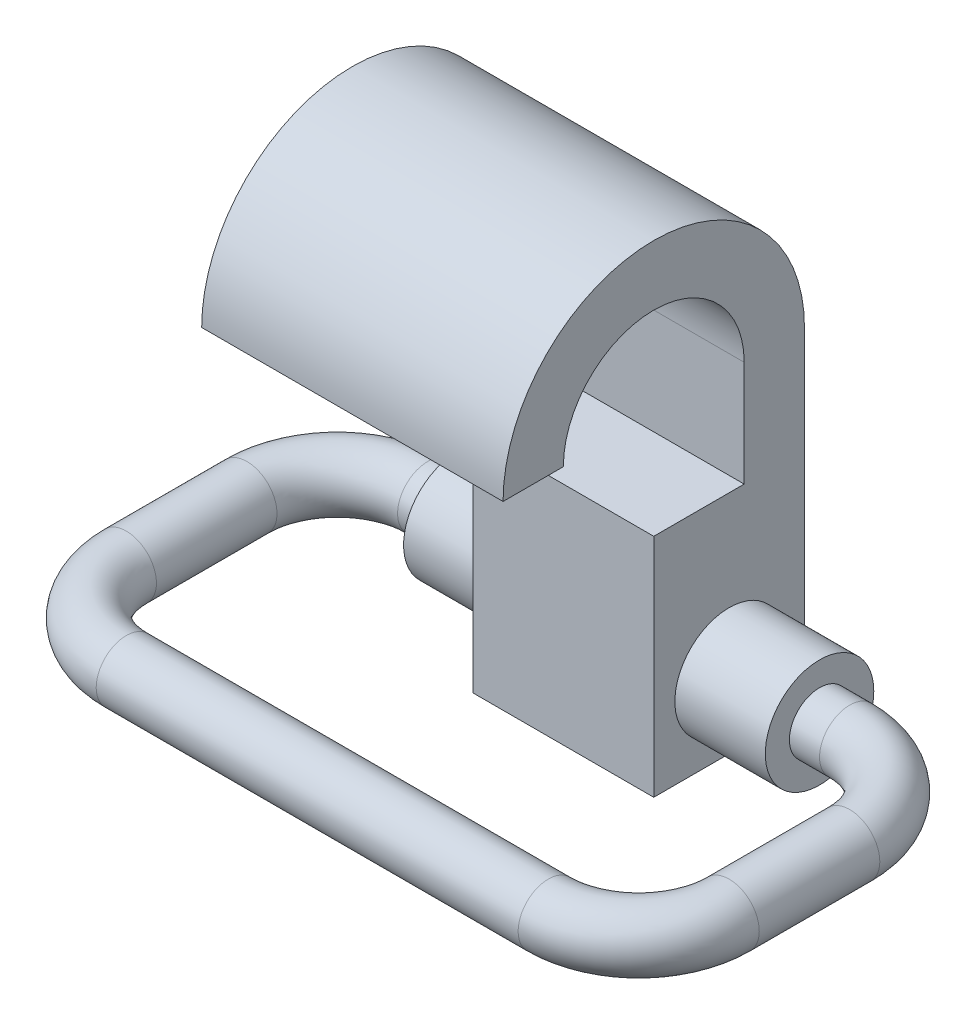
ISO-10303-21;
HEADER;
FILE_DESCRIPTION(('STEP AP214'),'2;1');
FILE_NAME('part.step','',(''),(''),'','','');
FILE_SCHEMA(('AUTOMOTIVE_DESIGN { 1 0 10303 214 1 1 1 1 }'));
ENDSEC;
DATA;
#1=APPLICATION_CONTEXT('core data for automotive mechanical design processes');
#2=APPLICATION_PROTOCOL_DEFINITION('international standard','automotive_design',2000,#1);
#3=PRODUCT_CONTEXT('',#1,'mechanical');
#4=PRODUCT('Part','Part','',(#3));
#5=PRODUCT_RELATED_PRODUCT_CATEGORY('part','',(#4));
#6=PRODUCT_DEFINITION_FORMATION('','',#4);
#7=PRODUCT_DEFINITION_CONTEXT('part definition',#1,'design');
#8=PRODUCT_DEFINITION('design','',#6,#7);
#9=PRODUCT_DEFINITION_SHAPE('','',#8);
#10=(LENGTH_UNIT() NAMED_UNIT(*) SI_UNIT(.MILLI.,.METRE.));
#11=(NAMED_UNIT(*) PLANE_ANGLE_UNIT() SI_UNIT($,.RADIAN.));
#12=(NAMED_UNIT(*) SI_UNIT($,.STERADIAN.) SOLID_ANGLE_UNIT());
#13=UNCERTAINTY_MEASURE_WITH_UNIT(LENGTH_MEASURE(1.E-05),#10,'distance_accuracy_value','');
#14=(GEOMETRIC_REPRESENTATION_CONTEXT(3) GLOBAL_UNCERTAINTY_ASSIGNED_CONTEXT((#13)) GLOBAL_UNIT_ASSIGNED_CONTEXT((#10,
#11,#12)) REPRESENTATION_CONTEXT('',''));
#15=CARTESIAN_POINT('',(0.,0.,0.));
#16=DIRECTION('',(0.,0.,1.));
#17=DIRECTION('',(1.,0.,0.));
#18=AXIS2_PLACEMENT_3D('',#15,#16,#17);
#19=CARTESIAN_POINT('',(-300.,725.,250.));
#20=DIRECTION('',(-1.,0.,0.));
#21=DIRECTION('',(0.,0.,-1.));
#22=AXIS2_PLACEMENT_3D('',#19,#20,#21);
#23=PLANE('',#22);
#24=CARTESIAN_POINT('',(-300.,-135.,0.));
#25=DIRECTION('',(1.,0.,0.));
#26=DIRECTION('',(0.,0.,-1.));
#27=AXIS2_PLACEMENT_3D('',#24,#25,#26);
#28=CIRCLE('',#27,180.);
#29=CARTESIAN_POINT('',(-300.,-135.,-180.));
#30=VERTEX_POINT('',#29);
#31=EDGE_CURVE('E40',#30,#30,#28,.F.);
#32=ORIENTED_EDGE('',*,*,#31,.F.);
#33=EDGE_LOOP('',(#32));
#34=FACE_BOUND('',#33,.T.);
#35=DIRECTION('',(0.,1.,0.));
#36=VECTOR('',#35,1.);
#37=CARTESIAN_POINT('',(-300.,724.999999999997,-50.));
#38=LINE('',#37,#36);
#39=CARTESIAN_POINT('',(-300.,375.,-50.));
#40=VERTEX_POINT('',#39);
#41=CARTESIAN_POINT('',(-300.,724.999999999997,-50.));
#42=VERTEX_POINT('',#41);
#43=EDGE_CURVE('E135',#40,#42,#38,.T.);
#44=ORIENTED_EDGE('',*,*,#43,.T.);
#45=DIRECTION('',(0.,0.,1.));
#46=VECTOR('',#45,1.);
#47=CARTESIAN_POINT('',(-300.,724.999999999997,-250.));
#48=LINE('',#47,#46);
#49=CARTESIAN_POINT('',(-300.,724.999999999997,-250.));
#50=VERTEX_POINT('',#49);
#51=EDGE_CURVE('E128',#50,#42,#48,.T.);
#52=ORIENTED_EDGE('',*,*,#51,.F.);
#53=DIRECTION('',(0.,-1.,0.));
#54=VECTOR('',#53,1.);
#55=CARTESIAN_POINT('',(-300.,375.,-250.));
#56=LINE('',#55,#54);
#57=CARTESIAN_POINT('',(-300.,-375.,-250.));
#58=VERTEX_POINT('',#57);
#59=EDGE_CURVE('E148',#50,#58,#56,.T.);
#60=ORIENTED_EDGE('',*,*,#59,.T.);
#61=DIRECTION('',(0.,0.,1.));
#62=VECTOR('',#61,1.);
#63=CARTESIAN_POINT('',(-300.,-375.,250.));
#64=LINE('',#63,#62);
#65=CARTESIAN_POINT('',(-300.,-375.,250.));
#66=VERTEX_POINT('',#65);
#67=EDGE_CURVE('E151',#58,#66,#64,.T.);
#68=ORIENTED_EDGE('',*,*,#67,.T.);
#69=DIRECTION('',(0.,1.,0.));
#70=VECTOR('',#69,1.);
#71=CARTESIAN_POINT('',(-300.,375.,250.));
#72=LINE('',#71,#70);
#73=CARTESIAN_POINT('',(-300.,375.,250.));
#74=VERTEX_POINT('',#73);
#75=EDGE_CURVE('E138',#66,#74,#72,.T.);
#76=ORIENTED_EDGE('',*,*,#75,.T.);
#77=DIRECTION('',(0.,0.,-1.));
#78=VECTOR('',#77,1.);
#79=CARTESIAN_POINT('',(-300.,375.,250.));
#80=LINE('',#79,#78);
#81=EDGE_CURVE('E145',#74,#40,#80,.T.);
#82=ORIENTED_EDGE('',*,*,#81,.T.);
#83=EDGE_LOOP('',(#44,#52,#60,#68,#76,#82));
#84=FACE_BOUND('',#83,.T.);
#85=ADVANCED_FACE('F36',(#34,#84),#23,.T.);
#86=CARTESIAN_POINT('',(300.,375.,0.));
#87=DIRECTION('',(0.,1.,0.));
#88=DIRECTION('',(0.,0.,1.));
#89=AXIS2_PLACEMENT_3D('',#86,#87,#88);
#90=PLANE('',#89);
#91=DIRECTION('',(1.,0.,0.));
#92=VECTOR('',#91,1.);
#93=CARTESIAN_POINT('',(0.,375.,-50.));
#94=LINE('',#93,#92);
#95=CARTESIAN_POINT('',(300.,375.,-50.));
#96=VERTEX_POINT('',#95);
#97=EDGE_CURVE('E191',#40,#96,#94,.T.);
#98=ORIENTED_EDGE('',*,*,#97,.F.);
#99=ORIENTED_EDGE('',*,*,#81,.F.);
#100=DIRECTION('',(-1.,0.,0.));
#101=VECTOR('',#100,1.);
#102=CARTESIAN_POINT('',(300.,375.,250.));
#103=LINE('',#102,#101);
#104=CARTESIAN_POINT('',(300.,375.,250.));
#105=VERTEX_POINT('',#104);
#106=EDGE_CURVE('E228',#105,#74,#103,.T.);
#107=ORIENTED_EDGE('',*,*,#106,.F.);
#108=DIRECTION('',(0.,0.,-1.));
#109=VECTOR('',#108,1.);
#110=CARTESIAN_POINT('',(300.,375.,0.));
#111=LINE('',#110,#109);
#112=EDGE_CURVE('E205',#105,#96,#111,.T.);
#113=ORIENTED_EDGE('',*,*,#112,.T.);
#114=EDGE_LOOP('',(#98,#99,#107,#113));
#115=FACE_BOUND('',#114,.T.);
#116=ADVANCED_FACE('F249',(#115),#90,.T.);
#117=CARTESIAN_POINT('',(-600.,-135.,0.));
#118=DIRECTION('',(1.,0.,0.));
#119=DIRECTION('',(0.,0.,-1.));
#120=AXIS2_PLACEMENT_3D('',#117,#118,#119);
#121=CYLINDRICAL_SURFACE('',#120,180.);
#122=CARTESIAN_POINT('',(-600.,-135.,0.));
#123=DIRECTION('',(1.,0.,0.));
#124=DIRECTION('',(0.,0.,-1.));
#125=AXIS2_PLACEMENT_3D('',#122,#123,#124);
#126=CIRCLE('',#125,180.);
#127=CARTESIAN_POINT('',(-600.,-135.,-180.));
#128=VERTEX_POINT('',#127);
#129=EDGE_CURVE('E154',#128,#128,#126,.T.);
#130=ORIENTED_EDGE('',*,*,#129,.T.);
#131=EDGE_LOOP('',(#130));
#132=FACE_BOUND('',#131,.T.);
#133=ORIENTED_EDGE('',*,*,#31,.T.);
#134=EDGE_LOOP('',(#133));
#135=FACE_BOUND('',#134,.T.);
#136=ADVANCED_FACE('F242',(#132,#135),#121,.T.);
#137=CARTESIAN_POINT('',(700.,-135.,0.));
#138=DIRECTION('',(-1.,0.,0.));
#139=DIRECTION('',(0.,0.,1.));
#140=AXIS2_PLACEMENT_3D('',#137,#138,#139);
#141=CYLINDRICAL_SURFACE('',#140,100.);
#142=CARTESIAN_POINT('',(600.,-135.,0.));
#143=DIRECTION('',(1.,0.,0.));
#144=DIRECTION('',(0.,0.,-1.));
#145=AXIS2_PLACEMENT_3D('',#142,#143,#144);
#146=CIRCLE('',#145,100.);
#147=CARTESIAN_POINT('',(600.,-135.,-100.));
#148=VERTEX_POINT('',#147);
#149=EDGE_CURVE('E230',#148,#148,#146,.T.);
#150=ORIENTED_EDGE('',*,*,#149,.T.);
#151=EDGE_LOOP('',(#150));
#152=FACE_BOUND('',#151,.T.);
#153=CARTESIAN_POINT('',(700.,-135.,0.));
#154=DIRECTION('',(1.,0.,0.));
#155=DIRECTION('',(0.,0.,-1.));
#156=AXIS2_PLACEMENT_3D('',#153,#154,#155);
#157=CIRCLE('',#156,100.);
#158=CARTESIAN_POINT('',(700.,-135.,-99.9999999999999));
#159=VERTEX_POINT('',#158);
#160=EDGE_CURVE('E45',#159,#159,#157,.T.);
#161=ORIENTED_EDGE('',*,*,#160,.F.);
#162=EDGE_LOOP('',(#161));
#163=FACE_BOUND('',#162,.T.);
#164=ADVANCED_FACE('F38',(#152,#163),#141,.T.);
#165=CARTESIAN_POINT('',(600.,-135.,0.));
#166=DIRECTION('',(-1.,0.,0.));
#167=DIRECTION('',(0.,0.,1.));
#168=AXIS2_PLACEMENT_3D('',#165,#166,#167);
#169=CYLINDRICAL_SURFACE('',#168,180.);
#170=CARTESIAN_POINT('',(300.,-135.,0.));
#171=DIRECTION('',(1.,0.,0.));
#172=DIRECTION('',(0.,0.,-1.));
#173=AXIS2_PLACEMENT_3D('',#170,#171,#172);
#174=CIRCLE('',#173,180.);
#175=CARTESIAN_POINT('',(300.,-135.,-180.));
#176=VERTEX_POINT('',#175);
#177=EDGE_CURVE('E199',#176,#176,#174,.T.);
#178=ORIENTED_EDGE('',*,*,#177,.T.);
#179=EDGE_LOOP('',(#178));
#180=FACE_BOUND('',#179,.T.);
#181=CARTESIAN_POINT('',(600.,-135.,0.));
#182=DIRECTION('',(1.,0.,0.));
#183=DIRECTION('',(0.,0.,-1.));
#184=AXIS2_PLACEMENT_3D('',#181,#182,#183);
#185=CIRCLE('',#184,180.);
#186=CARTESIAN_POINT('',(600.,-135.,-180.));
#187=VERTEX_POINT('',#186);
#188=EDGE_CURVE('E233',#187,#187,#185,.T.);
#189=ORIENTED_EDGE('',*,*,#188,.F.);
#190=EDGE_LOOP('',(#189));
#191=FACE_BOUND('',#190,.T.);
#192=ADVANCED_FACE('F241',(#180,#191),#169,.T.);
#193=CARTESIAN_POINT('',(600.,0.,0.));
#194=DIRECTION('',(1.,0.,0.));
#195=DIRECTION('',(0.,0.,-1.));
#196=AXIS2_PLACEMENT_3D('',#193,#194,#195);
#197=PLANE('',#196);
#198=ORIENTED_EDGE('',*,*,#149,.F.);
#199=EDGE_LOOP('',(#198));
#200=FACE_BOUND('',#199,.T.);
#201=ORIENTED_EDGE('',*,*,#188,.T.);
#202=EDGE_LOOP('',(#201));
#203=FACE_BOUND('',#202,.T.);
#204=ADVANCED_FACE('F248',(#200,#203),#197,.T.);
#205=CARTESIAN_POINT('',(300.,0.,250.));
#206=DIRECTION('',(0.,0.,1.));
#207=DIRECTION('',(0.,-1.,0.));
#208=AXIS2_PLACEMENT_3D('',#205,#206,#207);
#209=PLANE('',#208);
#210=ORIENTED_EDGE('',*,*,#106,.T.);
#211=ORIENTED_EDGE('',*,*,#75,.F.);
#212=DIRECTION('',(-1.,0.,0.));
#213=VECTOR('',#212,1.);
#214=CARTESIAN_POINT('',(300.,-375.,250.));
#215=LINE('',#214,#213);
#216=CARTESIAN_POINT('',(300.,-375.,250.));
#217=VERTEX_POINT('',#216);
#218=EDGE_CURVE('E60',#217,#66,#215,.T.);
#219=ORIENTED_EDGE('',*,*,#218,.F.);
#220=DIRECTION('',(0.,1.,0.));
#221=VECTOR('',#220,1.);
#222=CARTESIAN_POINT('',(300.,0.,250.));
#223=LINE('',#222,#221);
#224=EDGE_CURVE('E216',#217,#105,#223,.T.);
#225=ORIENTED_EDGE('',*,*,#224,.T.);
#226=EDGE_LOOP('',(#210,#211,#219,#225));
#227=FACE_BOUND('',#226,.T.);
#228=ADVANCED_FACE('F323',(#227),#209,.T.);
#229=CARTESIAN_POINT('',(300.,-375.,0.));
#230=DIRECTION('',(0.,1.,0.));
#231=DIRECTION('',(0.,0.,1.));
#232=AXIS2_PLACEMENT_3D('',#229,#230,#231);
#233=PLANE('',#232);
#234=ORIENTED_EDGE('',*,*,#218,.T.);
#235=ORIENTED_EDGE('',*,*,#67,.F.);
#236=DIRECTION('',(-1.,0.,0.));
#237=VECTOR('',#236,1.);
#238=CARTESIAN_POINT('',(300.,-375.,-250.));
#239=LINE('',#238,#237);
#240=CARTESIAN_POINT('',(300.,-375.,-250.));
#241=VERTEX_POINT('',#240);
#242=EDGE_CURVE('E225',#241,#58,#239,.T.);
#243=ORIENTED_EDGE('',*,*,#242,.F.);
#244=DIRECTION('',(0.,0.,-1.));
#245=VECTOR('',#244,1.);
#246=CARTESIAN_POINT('',(300.,-375.,0.));
#247=LINE('',#246,#245);
#248=EDGE_CURVE('E218',#217,#241,#247,.T.);
#249=ORIENTED_EDGE('',*,*,#248,.F.);
#250=EDGE_LOOP('',(#234,#235,#243,#249));
#251=FACE_BOUND('',#250,.T.);
#252=ADVANCED_FACE('F320',(#251),#233,.F.);
#253=CARTESIAN_POINT('',(300.,0.,-250.));
#254=DIRECTION('',(0.,0.,1.));
#255=DIRECTION('',(0.,-1.,0.));
#256=AXIS2_PLACEMENT_3D('',#253,#254,#255);
#257=PLANE('',#256);
#258=ORIENTED_EDGE('',*,*,#242,.T.);
#259=ORIENTED_EDGE('',*,*,#59,.F.);
#260=DIRECTION('',(-1.,0.,0.));
#261=VECTOR('',#260,1.);
#262=CARTESIAN_POINT('',(0.,725.,-250.));
#263=LINE('',#262,#261);
#264=CARTESIAN_POINT('',(300.,725.,-250.));
#265=VERTEX_POINT('',#264);
#266=EDGE_CURVE('E133',#265,#50,#263,.T.);
#267=ORIENTED_EDGE('',*,*,#266,.F.);
#268=DIRECTION('',(0.,1.,0.));
#269=VECTOR('',#268,1.);
#270=CARTESIAN_POINT('',(300.,0.,-250.));
#271=LINE('',#270,#269);
#272=EDGE_CURVE('E52',#241,#265,#271,.T.);
#273=ORIENTED_EDGE('',*,*,#272,.F.);
#274=EDGE_LOOP('',(#258,#259,#267,#273));
#275=FACE_BOUND('',#274,.T.);
#276=ADVANCED_FACE('F316',(#275),#257,.F.);
#277=CARTESIAN_POINT('',(300.,0.,0.));
#278=DIRECTION('',(1.,0.,0.));
#279=DIRECTION('',(0.,0.,-1.));
#280=AXIS2_PLACEMENT_3D('',#277,#278,#279);
#281=PLANE('',#280);
#282=ORIENTED_EDGE('',*,*,#177,.F.);
#283=EDGE_LOOP('',(#282));
#284=FACE_BOUND('',#283,.T.);
#285=ORIENTED_EDGE('',*,*,#112,.F.);
#286=ORIENTED_EDGE('',*,*,#224,.F.);
#287=ORIENTED_EDGE('',*,*,#248,.T.);
#288=ORIENTED_EDGE('',*,*,#272,.T.);
#289=CARTESIAN_POINT('',(300.,725.,250.));
#290=DIRECTION('',(1.,0.,0.));
#291=DIRECTION('',(0.,0.,-1.));
#292=AXIS2_PLACEMENT_3D('',#289,#290,#291);
#293=CIRCLE('',#292,500.);
#294=CARTESIAN_POINT('',(300.,725.,750.));
#295=VERTEX_POINT('',#294);
#296=EDGE_CURVE('E184',#265,#295,#293,.T.);
#297=ORIENTED_EDGE('',*,*,#296,.T.);
#298=DIRECTION('',(0.,0.,-1.));
#299=VECTOR('',#298,1.);
#300=CARTESIAN_POINT('',(300.,725.,750.));
#301=LINE('',#300,#299);
#302=CARTESIAN_POINT('',(300.,725.,550.));
#303=VERTEX_POINT('',#302);
#304=EDGE_CURVE('E181',#295,#303,#301,.T.);
#305=ORIENTED_EDGE('',*,*,#304,.T.);
#306=CARTESIAN_POINT('',(300.,725.,250.));
#307=DIRECTION('',(1.,0.,0.));
#308=DIRECTION('',(0.,0.,-1.));
#309=AXIS2_PLACEMENT_3D('',#306,#307,#308);
#310=CIRCLE('',#309,300.);
#311=CARTESIAN_POINT('',(300.,725.,-50.));
#312=VERTEX_POINT('',#311);
#313=EDGE_CURVE('E178',#312,#303,#310,.T.);
#314=ORIENTED_EDGE('',*,*,#313,.F.);
#315=DIRECTION('',(0.,-1.,0.));
#316=VECTOR('',#315,1.);
#317=CARTESIAN_POINT('',(300.,725.,-50.));
#318=LINE('',#317,#316);
#319=EDGE_CURVE('E196',#312,#96,#318,.T.);
#320=ORIENTED_EDGE('',*,*,#319,.T.);
#321=EDGE_LOOP('',(#285,#286,#287,#288,#297,#305,#314,#320));
#322=FACE_BOUND('',#321,.T.);
#323=ADVANCED_FACE('F312',(#284,#322),#281,.T.);
#324=CARTESIAN_POINT('',(0.,725.,-50.));
#325=DIRECTION('',(0.,0.,-1.));
#326=DIRECTION('',(-1.,0.,0.));
#327=AXIS2_PLACEMENT_3D('',#324,#325,#326);
#328=PLANE('',#327);
#329=ORIENTED_EDGE('',*,*,#97,.T.);
#330=ORIENTED_EDGE('',*,*,#319,.F.);
#331=DIRECTION('',(1.,0.,0.));
#332=VECTOR('',#331,1.);
#333=CARTESIAN_POINT('',(0.,725.,-50.));
#334=LINE('',#333,#332);
#335=EDGE_CURVE('E193',#42,#312,#334,.T.);
#336=ORIENTED_EDGE('',*,*,#335,.F.);
#337=ORIENTED_EDGE('',*,*,#43,.F.);
#338=EDGE_LOOP('',(#329,#330,#336,#337));
#339=FACE_BOUND('',#338,.T.);
#340=ADVANCED_FACE('F308',(#339),#328,.F.);
#341=CARTESIAN_POINT('',(0.,725.,250.));
#342=DIRECTION('',(1.,0.,0.));
#343=DIRECTION('',(0.,0.,-1.));
#344=AXIS2_PLACEMENT_3D('',#341,#342,#343);
#345=CYLINDRICAL_SURFACE('',#344,300.);
#346=ORIENTED_EDGE('',*,*,#313,.T.);
#347=DIRECTION('',(1.,0.,0.));
#348=VECTOR('',#347,1.);
#349=CARTESIAN_POINT('',(0.,725.,550.));
#350=LINE('',#349,#348);
#351=CARTESIAN_POINT('',(-700.,725.,550.));
#352=VERTEX_POINT('',#351);
#353=EDGE_CURVE('E189',#352,#303,#350,.T.);
#354=ORIENTED_EDGE('',*,*,#353,.F.);
#355=CARTESIAN_POINT('',(-700.,725.,250.));
#356=DIRECTION('',(1.,0.,0.));
#357=DIRECTION('',(0.,0.,1.));
#358=AXIS2_PLACEMENT_3D('',#355,#356,#357);
#359=CIRCLE('',#358,300.);
#360=CARTESIAN_POINT('',(-700.,724.999999999997,-50.));
#361=VERTEX_POINT('',#360);
#362=EDGE_CURVE('E119',#361,#352,#359,.T.);
#363=ORIENTED_EDGE('',*,*,#362,.F.);
#364=DIRECTION('',(1.,0.,0.));
#365=VECTOR('',#364,1.);
#366=CARTESIAN_POINT('',(-700.,724.999999999997,-50.));
#367=LINE('',#366,#365);
#368=EDGE_CURVE('E115',#361,#42,#367,.T.);
#369=ORIENTED_EDGE('',*,*,#368,.T.);
#370=ORIENTED_EDGE('',*,*,#335,.T.);
#371=EDGE_LOOP('',(#346,#354,#363,#369,#370));
#372=FACE_BOUND('',#371,.T.);
#373=ADVANCED_FACE('F304',(#372),#345,.F.);
#374=CARTESIAN_POINT('',(0.,725.,750.));
#375=DIRECTION('',(0.,-1.,0.));
#376=DIRECTION('',(0.,0.,-1.));
#377=AXIS2_PLACEMENT_3D('',#374,#375,#376);
#378=PLANE('',#377);
#379=ORIENTED_EDGE('',*,*,#304,.F.);
#380=DIRECTION('',(1.,0.,0.));
#381=VECTOR('',#380,1.);
#382=CARTESIAN_POINT('',(0.,725.,750.));
#383=LINE('',#382,#381);
#384=CARTESIAN_POINT('',(-700.,725.,750.));
#385=VERTEX_POINT('',#384);
#386=EDGE_CURVE('E187',#385,#295,#383,.T.);
#387=ORIENTED_EDGE('',*,*,#386,.F.);
#388=DIRECTION('',(0.,0.,1.));
#389=VECTOR('',#388,1.);
#390=CARTESIAN_POINT('',(-700.,725.,550.));
#391=LINE('',#390,#389);
#392=EDGE_CURVE('E126',#352,#385,#391,.T.);
#393=ORIENTED_EDGE('',*,*,#392,.F.);
#394=ORIENTED_EDGE('',*,*,#353,.T.);
#395=EDGE_LOOP('',(#379,#387,#393,#394));
#396=FACE_BOUND('',#395,.T.);
#397=ADVANCED_FACE('F301',(#396),#378,.T.);
#398=CARTESIAN_POINT('',(0.,725.,250.));
#399=DIRECTION('',(1.,0.,0.));
#400=DIRECTION('',(0.,0.,-1.));
#401=AXIS2_PLACEMENT_3D('',#398,#399,#400);
#402=CYLINDRICAL_SURFACE('',#401,500.);
#403=ORIENTED_EDGE('',*,*,#296,.F.);
#404=ORIENTED_EDGE('',*,*,#266,.T.);
#405=DIRECTION('',(1.,0.,0.));
#406=VECTOR('',#405,1.);
#407=CARTESIAN_POINT('',(-700.,724.999999999997,-250.));
#408=LINE('',#407,#406);
#409=CARTESIAN_POINT('',(-700.,724.999999999997,-250.));
#410=VERTEX_POINT('',#409);
#411=EDGE_CURVE('E112',#410,#50,#408,.T.);
#412=ORIENTED_EDGE('',*,*,#411,.F.);
#413=CARTESIAN_POINT('',(-700.,725.,250.));
#414=DIRECTION('',(-1.,0.,0.));
#415=DIRECTION('',(0.,0.,1.));
#416=AXIS2_PLACEMENT_3D('',#413,#414,#415);
#417=CIRCLE('',#416,500.);
#418=EDGE_CURVE('E120',#385,#410,#417,.T.);
#419=ORIENTED_EDGE('',*,*,#418,.F.);
#420=ORIENTED_EDGE('',*,*,#386,.T.);
#421=EDGE_LOOP('',(#403,#404,#412,#419,#420));
#422=FACE_BOUND('',#421,.T.);
#423=ADVANCED_FACE('F132',(#422),#402,.T.);
#424=CARTESIAN_POINT('',(700.,-135.,300.));
#425=DIRECTION('',(0.,1.,0.));
#426=DIRECTION('',(0.,0.,1.));
#427=AXIS2_PLACEMENT_3D('',#424,#425,#426);
#428=TOROIDAL_SURFACE('',#427,300.,100.);
#429=CARTESIAN_POINT('',(1000.,-135.,300.));
#430=DIRECTION('',(0.,0.,1.));
#431=DIRECTION('',(1.,0.,0.));
#432=AXIS2_PLACEMENT_3D('',#429,#430,#431);
#433=CIRCLE('',#432,100.);
#434=CARTESIAN_POINT('',(1100.,-135.,300.));
#435=VERTEX_POINT('',#434);
#436=EDGE_CURVE('E175',#435,#435,#433,.T.);
#437=CARTESIAN_POINT('',(700.,-135.,300.));
#438=DIRECTION('',(0.,1.,0.));
#439=DIRECTION('',(0.,0.,1.));
#440=AXIS2_PLACEMENT_3D('',#437,#438,#439);
#441=CIRCLE('',#440,400.);
#442=EDGE_CURVE('',#435,#159,#441,.T.);
#443=ORIENTED_EDGE('',*,*,#436,.F.);
#444=ORIENTED_EDGE('',*,*,#160,.T.);
#445=ORIENTED_EDGE('',*,*,#442,.T.);
#446=ORIENTED_EDGE('',*,*,#442,.F.);
#447=EDGE_LOOP('',(#443,#445,#444,#446));
#448=FACE_BOUND('',#447,.T.);
#449=ADVANCED_FACE('F238',(#448),#428,.T.);
#450=CARTESIAN_POINT('',(1000.,-135.,700.));
#451=DIRECTION('',(0.,0.,-1.));
#452=DIRECTION('',(-1.,0.,0.));
#453=AXIS2_PLACEMENT_3D('',#450,#451,#452);
#454=CYLINDRICAL_SURFACE('',#453,100.);
#455=CARTESIAN_POINT('',(1000.,-135.,700.));
#456=DIRECTION('',(0.,0.,1.));
#457=DIRECTION('',(1.,0.,0.));
#458=AXIS2_PLACEMENT_3D('',#455,#456,#457);
#459=CIRCLE('',#458,100.);
#460=CARTESIAN_POINT('',(1100.,-135.,700.));
#461=VERTEX_POINT('',#460);
#462=EDGE_CURVE('E172',#461,#461,#459,.T.);
#463=ORIENTED_EDGE('',*,*,#462,.F.);
#464=EDGE_LOOP('',(#463));
#465=FACE_BOUND('',#464,.T.);
#466=ORIENTED_EDGE('',*,*,#436,.T.);
#467=EDGE_LOOP('',(#466));
#468=FACE_BOUND('',#467,.T.);
#469=ADVANCED_FACE('F291',(#465,#468),#454,.T.);
#470=CARTESIAN_POINT('',(700.,-135.,700.));
#471=DIRECTION('',(0.,1.,0.));
#472=DIRECTION('',(0.,0.,1.));
#473=AXIS2_PLACEMENT_3D('',#470,#471,#472);
#474=TOROIDAL_SURFACE('',#473,300.,100.);
#475=CARTESIAN_POINT('',(700.,-135.,1000.));
#476=DIRECTION('',(-1.,0.,0.));
#477=DIRECTION('',(0.,0.,1.));
#478=AXIS2_PLACEMENT_3D('',#475,#476,#477);
#479=CIRCLE('',#478,100.);
#480=CARTESIAN_POINT('',(700.,-135.,1100.));
#481=VERTEX_POINT('',#480);
#482=EDGE_CURVE('E169',#481,#481,#479,.T.);
#483=CARTESIAN_POINT('',(700.,-135.,700.));
#484=DIRECTION('',(0.,1.,0.));
#485=DIRECTION('',(0.,0.,1.));
#486=AXIS2_PLACEMENT_3D('',#483,#484,#485);
#487=CIRCLE('',#486,400.);
#488=EDGE_CURVE('',#481,#461,#487,.T.);
#489=ORIENTED_EDGE('',*,*,#482,.F.);
#490=ORIENTED_EDGE('',*,*,#462,.T.);
#491=ORIENTED_EDGE('',*,*,#488,.T.);
#492=ORIENTED_EDGE('',*,*,#488,.F.);
#493=EDGE_LOOP('',(#489,#491,#490,#492));
#494=FACE_BOUND('',#493,.T.);
#495=ADVANCED_FACE('F287',(#494),#474,.T.);
#496=CARTESIAN_POINT('',(-1.11022302462516E-13,-135.,1000.));
#497=DIRECTION('',(1.,0.,0.));
#498=DIRECTION('',(0.,1.,0.));
#499=AXIS2_PLACEMENT_3D('',#496,#497,#498);
#500=CYLINDRICAL_SURFACE('',#499,100.);
#501=ORIENTED_EDGE('',*,*,#482,.T.);
#502=EDGE_LOOP('',(#501));
#503=FACE_BOUND('',#502,.T.);
#504=CARTESIAN_POINT('',(-700.,-135.,1000.));
#505=DIRECTION('',(-1.,0.,0.));
#506=DIRECTION('',(0.,-1.,0.));
#507=AXIS2_PLACEMENT_3D('',#504,#505,#506);
#508=CIRCLE('',#507,100.);
#509=CARTESIAN_POINT('',(-700.,-135.,1100.));
#510=VERTEX_POINT('',#509);
#511=EDGE_CURVE('E166',#510,#510,#508,.T.);
#512=ORIENTED_EDGE('',*,*,#511,.F.);
#513=EDGE_LOOP('',(#512));
#514=FACE_BOUND('',#513,.T.);
#515=ADVANCED_FACE('F283',(#503,#514),#500,.T.);
#516=CARTESIAN_POINT('',(-700.,-135.,700.));
#517=DIRECTION('',(0.,-1.,0.));
#518=DIRECTION('',(0.,0.,-1.));
#519=AXIS2_PLACEMENT_3D('',#516,#517,#518);
#520=TOROIDAL_SURFACE('',#519,300.,100.);
#521=CARTESIAN_POINT('',(-1000.,-135.,700.));
#522=DIRECTION('',(0.,0.,-1.));
#523=DIRECTION('',(-1.,0.,0.));
#524=AXIS2_PLACEMENT_3D('',#521,#522,#523);
#525=CIRCLE('',#524,100.);
#526=CARTESIAN_POINT('',(-1100.,-135.,700.));
#527=VERTEX_POINT('',#526);
#528=EDGE_CURVE('E163',#527,#527,#525,.T.);
#529=CARTESIAN_POINT('',(-700.,-135.,700.));
#530=DIRECTION('',(0.,-1.,0.));
#531=DIRECTION('',(0.,0.,-1.));
#532=AXIS2_PLACEMENT_3D('',#529,#530,#531);
#533=CIRCLE('',#532,400.);
#534=EDGE_CURVE('',#510,#527,#533,.T.);
#535=ORIENTED_EDGE('',*,*,#511,.T.);
#536=ORIENTED_EDGE('',*,*,#528,.F.);
#537=ORIENTED_EDGE('',*,*,#534,.T.);
#538=ORIENTED_EDGE('',*,*,#534,.F.);
#539=EDGE_LOOP('',(#535,#537,#536,#538));
#540=FACE_BOUND('',#539,.T.);
#541=ADVANCED_FACE('F279',(#540),#520,.T.);
#542=CARTESIAN_POINT('',(-1000.,-135.,700.));
#543=DIRECTION('',(0.,0.,-1.));
#544=DIRECTION('',(-1.,0.,0.));
#545=AXIS2_PLACEMENT_3D('',#542,#543,#544);
#546=CYLINDRICAL_SURFACE('',#545,100.);
#547=ORIENTED_EDGE('',*,*,#528,.T.);
#548=EDGE_LOOP('',(#547));
#549=FACE_BOUND('',#548,.T.);
#550=CARTESIAN_POINT('',(-1000.,-135.,300.));
#551=DIRECTION('',(0.,0.,-1.));
#552=DIRECTION('',(-1.,0.,0.));
#553=AXIS2_PLACEMENT_3D('',#550,#551,#552);
#554=CIRCLE('',#553,100.);
#555=CARTESIAN_POINT('',(-1100.,-135.,300.));
#556=VERTEX_POINT('',#555);
#557=EDGE_CURVE('E160',#556,#556,#554,.T.);
#558=ORIENTED_EDGE('',*,*,#557,.F.);
#559=EDGE_LOOP('',(#558));
#560=FACE_BOUND('',#559,.T.);
#561=ADVANCED_FACE('F275',(#549,#560),#546,.T.);
#562=CARTESIAN_POINT('',(-700.,-135.,300.));
#563=DIRECTION('',(0.,-1.,0.));
#564=DIRECTION('',(0.,0.,-1.));
#565=AXIS2_PLACEMENT_3D('',#562,#563,#564);
#566=TOROIDAL_SURFACE('',#565,300.,100.);
#567=CARTESIAN_POINT('',(-700.,-135.,0.));
#568=DIRECTION('',(1.,0.,0.));
#569=DIRECTION('',(0.,0.,-1.));
#570=AXIS2_PLACEMENT_3D('',#567,#568,#569);
#571=CIRCLE('',#570,100.);
#572=CARTESIAN_POINT('',(-700.,-135.,-99.9999999999999));
#573=VERTEX_POINT('',#572);
#574=EDGE_CURVE('E157',#573,#573,#571,.T.);
#575=CARTESIAN_POINT('',(-700.,-135.,300.));
#576=DIRECTION('',(0.,-1.,0.));
#577=DIRECTION('',(0.,0.,-1.));
#578=AXIS2_PLACEMENT_3D('',#575,#576,#577);
#579=CIRCLE('',#578,400.);
#580=EDGE_CURVE('',#556,#573,#579,.T.);
#581=ORIENTED_EDGE('',*,*,#557,.T.);
#582=ORIENTED_EDGE('',*,*,#574,.F.);
#583=ORIENTED_EDGE('',*,*,#580,.T.);
#584=ORIENTED_EDGE('',*,*,#580,.F.);
#585=EDGE_LOOP('',(#581,#583,#582,#584));
#586=FACE_BOUND('',#585,.T.);
#587=ADVANCED_FACE('F271',(#586),#566,.T.);
#588=CARTESIAN_POINT('',(-700.,-135.,0.));
#589=DIRECTION('',(1.,0.,0.));
#590=DIRECTION('',(0.,0.,-1.));
#591=AXIS2_PLACEMENT_3D('',#588,#589,#590);
#592=CYLINDRICAL_SURFACE('',#591,100.);
#593=CARTESIAN_POINT('',(-600.,-135.,0.));
#594=DIRECTION('',(-1.,0.,0.));
#595=DIRECTION('',(0.,0.,1.));
#596=AXIS2_PLACEMENT_3D('',#593,#594,#595);
#597=CIRCLE('',#596,100.);
#598=CARTESIAN_POINT('',(-600.,-135.,100.));
#599=VERTEX_POINT('',#598);
#600=EDGE_CURVE('E11',#599,#599,#597,.F.);
#601=ORIENTED_EDGE('',*,*,#600,.F.);
#602=EDGE_LOOP('',(#601));
#603=FACE_BOUND('',#602,.T.);
#604=ORIENTED_EDGE('',*,*,#574,.T.);
#605=EDGE_LOOP('',(#604));
#606=FACE_BOUND('',#605,.T.);
#607=ADVANCED_FACE('F266',(#603,#606),#592,.T.);
#608=CARTESIAN_POINT('',(-600.,0.,0.));
#609=DIRECTION('',(-1.,0.,0.));
#610=DIRECTION('',(0.,0.,-1.));
#611=AXIS2_PLACEMENT_3D('',#608,#609,#610);
#612=PLANE('',#611);
#613=ORIENTED_EDGE('',*,*,#600,.T.);
#614=EDGE_LOOP('',(#613));
#615=FACE_BOUND('',#614,.T.);
#616=ORIENTED_EDGE('',*,*,#129,.F.);
#617=EDGE_LOOP('',(#616));
#618=FACE_BOUND('',#617,.T.);
#619=ADVANCED_FACE('F264',(#615,#618),#612,.T.);
#620=CARTESIAN_POINT('',(-700.,724.999999999997,-250.));
#621=DIRECTION('',(0.,1.,0.));
#622=DIRECTION('',(0.,0.,1.));
#623=AXIS2_PLACEMENT_3D('',#620,#621,#622);
#624=PLANE('',#623);
#625=ORIENTED_EDGE('',*,*,#51,.T.);
#626=ORIENTED_EDGE('',*,*,#368,.F.);
#627=DIRECTION('',(0.,0.,1.));
#628=VECTOR('',#627,1.);
#629=CARTESIAN_POINT('',(-700.,724.999999999997,-250.));
#630=LINE('',#629,#628);
#631=EDGE_CURVE('E108',#410,#361,#630,.T.);
#632=ORIENTED_EDGE('',*,*,#631,.F.);
#633=ORIENTED_EDGE('',*,*,#411,.T.);
#634=EDGE_LOOP('',(#625,#626,#632,#633));
#635=FACE_BOUND('',#634,.T.);
#636=ADVANCED_FACE('F110',(#635),#624,.F.);
#637=CARTESIAN_POINT('',(-700.,725.,250.));
#638=DIRECTION('',(-1.,0.,0.));
#639=DIRECTION('',(0.,0.,1.));
#640=AXIS2_PLACEMENT_3D('',#637,#638,#639);
#641=PLANE('',#640);
#642=ORIENTED_EDGE('',*,*,#418,.T.);
#643=ORIENTED_EDGE('',*,*,#631,.T.);
#644=ORIENTED_EDGE('',*,*,#362,.T.);
#645=ORIENTED_EDGE('',*,*,#392,.T.);
#646=EDGE_LOOP('',(#642,#643,#644,#645));
#647=FACE_BOUND('',#646,.T.);
#648=ADVANCED_FACE('F124',(#647),#641,.T.);
#649=CLOSED_SHELL('',(#85,#116,#136,#164,#192,#204,#228,#252,#276,#323,#340,#373,#397,#423,#449,
#469,#495,#515,#541,#561,#587,#607,#619,#636,#648));
#650=MANIFOLD_SOLID_BREP('B2',#649);
#651=ADVANCED_BREP_SHAPE_REPRESENTATION('',(#18,#650),#14);
#652=SHAPE_DEFINITION_REPRESENTATION(#9,#651);
ENDSEC;
END-ISO-10303-21;
